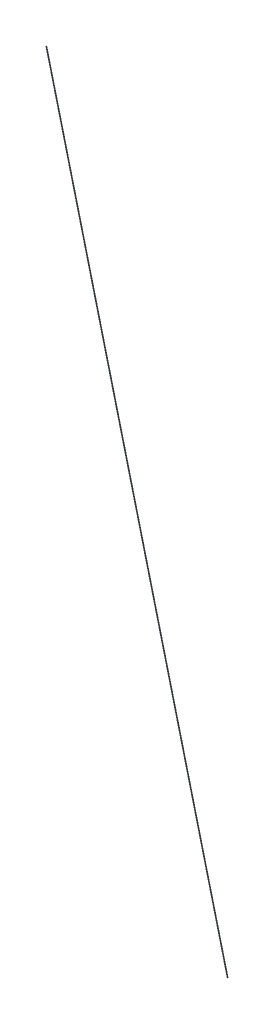
ISO-10303-21;
HEADER;
FILE_DESCRIPTION(('STEP AP214'),'2;1');
FILE_NAME('part.step','',(''),(''),'','','');
FILE_SCHEMA(('AUTOMOTIVE_DESIGN { 1 0 10303 214 1 1 1 1 }'));
ENDSEC;
DATA;
#1=APPLICATION_CONTEXT('core data for automotive mechanical design processes');
#2=APPLICATION_PROTOCOL_DEFINITION('international standard','automotive_design',2000,#1);
#3=PRODUCT_CONTEXT('',#1,'mechanical');
#4=PRODUCT('Part','Part','',(#3));
#5=PRODUCT_RELATED_PRODUCT_CATEGORY('part','',(#4));
#6=PRODUCT_DEFINITION_FORMATION('','',#4);
#7=PRODUCT_DEFINITION_CONTEXT('part definition',#1,'design');
#8=PRODUCT_DEFINITION('design','',#6,#7);
#9=PRODUCT_DEFINITION_SHAPE('','',#8);
#10=(LENGTH_UNIT() NAMED_UNIT(*) SI_UNIT(.MILLI.,.METRE.));
#11=(NAMED_UNIT(*) PLANE_ANGLE_UNIT() SI_UNIT($,.RADIAN.));
#12=(NAMED_UNIT(*) SI_UNIT($,.STERADIAN.) SOLID_ANGLE_UNIT());
#13=UNCERTAINTY_MEASURE_WITH_UNIT(LENGTH_MEASURE(1.E-05),#10,'distance_accuracy_value','');
#14=(GEOMETRIC_REPRESENTATION_CONTEXT(3) GLOBAL_UNCERTAINTY_ASSIGNED_CONTEXT((#13)) GLOBAL_UNIT_ASSIGNED_CONTEXT((#10,
#11,#12)) REPRESENTATION_CONTEXT('',''));
#15=CARTESIAN_POINT('',(0.,0.,0.));
#16=DIRECTION('',(0.,0.,1.));
#17=DIRECTION('',(1.,0.,0.));
#18=AXIS2_PLACEMENT_3D('',#15,#16,#17);
#19=CARTESIAN_POINT('',(0.,60.,0.));
#20=DIRECTION('',(0.,0.,1.));
#21=DIRECTION('',(1.,0.,0.));
#22=AXIS2_PLACEMENT_3D('',#19,#20,#21);
#23=PLANE('',#22);
#24=CARTESIAN_POINT('',(0.,60.,0.));
#25=DIRECTION('',(0.,0.,1.));
#26=DIRECTION('',(1.,0.,0.));
#27=AXIS2_PLACEMENT_3D('',#24,#25,#26);
#28=CIRCLE('',#27,5.);
#29=CARTESIAN_POINT('',(5.,60.,0.));
#30=VERTEX_POINT('',#29);
#31=EDGE_CURVE('E24',#30,#30,#28,.T.);
#32=ORIENTED_EDGE('',*,*,#31,.F.);
#33=EDGE_LOOP('',(#32));
#34=FACE_BOUND('',#33,.T.);
#35=ADVANCED_FACE('F17',(#34),#23,.F.);
#36=CARTESIAN_POINT('',(-121.687284181983,10776.799525431,2067.82944726593));
#37=DIRECTION('',(0.,0.,1.));
#38=DIRECTION('',(1.,0.,0.));
#39=AXIS2_PLACEMENT_3D('',#36,#37,#38);
#40=PLANE('',#39);
#41=CARTESIAN_POINT('',(-121.687284181983,10776.799525431,2067.82944726593));
#42=DIRECTION('',(0.,0.,1.));
#43=DIRECTION('',(1.,0.,0.));
#44=AXIS2_PLACEMENT_3D('',#41,#42,#43);
#45=CIRCLE('',#44,5.);
#46=CARTESIAN_POINT('',(-116.687284181983,10776.799525431,2067.82944726593));
#47=VERTEX_POINT('',#46);
#48=EDGE_CURVE('E11',#47,#47,#45,.T.);
#49=ORIENTED_EDGE('',*,*,#48,.T.);
#50=EDGE_LOOP('',(#49));
#51=FACE_BOUND('',#50,.T.);
#52=ADVANCED_FACE('F31',(#51),#40,.T.);
#53=CARTESIAN_POINT('',(5.,60.,0.));
#54=CARTESIAN_POINT('',(-116.687284181983,10776.799525431,2067.82944726593));
#55=CARTESIAN_POINT('',(4.99999999999999,70.,0.));
#56=CARTESIAN_POINT('',(-116.687284181983,10786.799525431,2067.82944726593));
#57=CARTESIAN_POINT('',(-5.00000000000001,70.,0.));
#58=CARTESIAN_POINT('',(-126.687284181983,10786.799525431,2067.82944726593));
#59=CARTESIAN_POINT('',(-5.,60.,0.));
#60=CARTESIAN_POINT('',(-126.687284181983,10776.799525431,2067.82944726593));
#61=CARTESIAN_POINT('',(-5.00000000000001,49.9999999999999,0.));
#62=CARTESIAN_POINT('',(-126.687284181983,10766.799525431,2067.82944726593));
#63=CARTESIAN_POINT('',(4.99999999999999,49.9999999999999,0.));
#64=CARTESIAN_POINT('',(-116.687284181983,10766.799525431,2067.82944726593));
#65=CARTESIAN_POINT('',(5.,60.,0.));
#66=CARTESIAN_POINT('',(-116.687284181983,10776.799525431,2067.82944726593));
#67=(BOUNDED_SURFACE() B_SPLINE_SURFACE(3,1,((#53,#54),(#55,#56),(#57,#58),(#59,#60),(#61,#62),
(#63,#64),(#65,#66)),.UNSPECIFIED.,.T.,.F.,.F.) B_SPLINE_SURFACE_WITH_KNOTS((4,3,4),(2,2),(0.,
0.5,1.),(0.,1.),.UNSPECIFIED.) GEOMETRIC_REPRESENTATION_ITEM() RATIONAL_B_SPLINE_SURFACE(((1.,
1.),(0.333333333333334,0.333333333333334),(0.333333333333334,0.333333333333334),(1.,1.),
(0.333333333333334,0.333333333333334),(0.333333333333334,0.333333333333334),(1.,1.))) REPRESENTATION_ITEM('') SURFACE());
#68=ORIENTED_EDGE('',*,*,#48,.F.);
#69=EDGE_LOOP('',(#68));
#70=FACE_BOUND('',#69,.T.);
#71=ORIENTED_EDGE('',*,*,#31,.T.);
#72=EDGE_LOOP('',(#71));
#73=FACE_BOUND('',#72,.T.);
#74=ADVANCED_FACE('F33',(#70,#73),#67,.T.);
#75=CLOSED_SHELL('',(#35,#52,#74));
#76=MANIFOLD_SOLID_BREP('B1',#75);
#77=ADVANCED_BREP_SHAPE_REPRESENTATION('',(#18,#76),#14);
#78=SHAPE_DEFINITION_REPRESENTATION(#9,#77);
ENDSEC;
END-ISO-10303-21;
